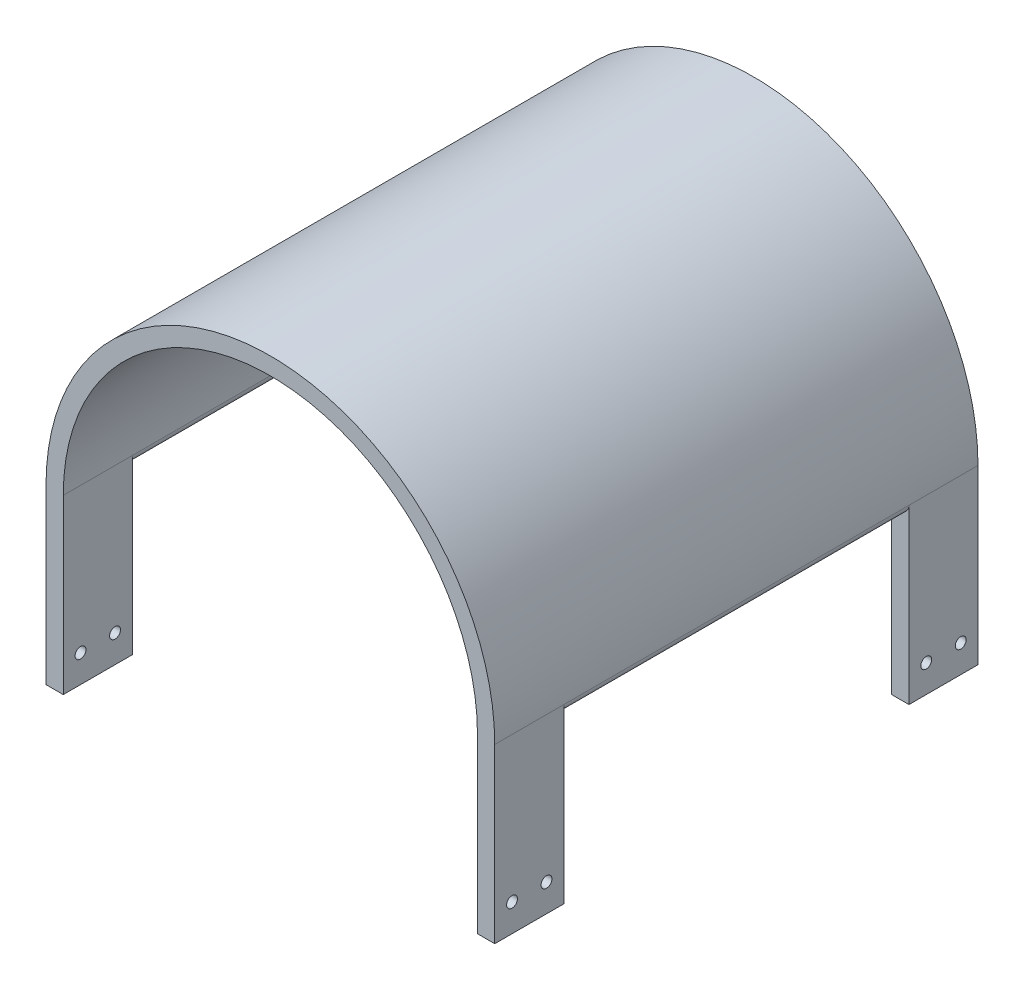
ISO-10303-21;
HEADER;
FILE_DESCRIPTION(('STEP AP214'),'2;1');
FILE_NAME('part.step','',(''),(''),'','','');
FILE_SCHEMA(('AUTOMOTIVE_DESIGN { 1 0 10303 214 1 1 1 1 }'));
ENDSEC;
DATA;
#1=APPLICATION_CONTEXT('core data for automotive mechanical design processes');
#2=APPLICATION_PROTOCOL_DEFINITION('international standard','automotive_design',2000,#1);
#3=PRODUCT_CONTEXT('',#1,'mechanical');
#4=PRODUCT('Part','Part','',(#3));
#5=PRODUCT_RELATED_PRODUCT_CATEGORY('part','',(#4));
#6=PRODUCT_DEFINITION_FORMATION('','',#4);
#7=PRODUCT_DEFINITION_CONTEXT('part definition',#1,'design');
#8=PRODUCT_DEFINITION('design','',#6,#7);
#9=PRODUCT_DEFINITION_SHAPE('','',#8);
#10=(LENGTH_UNIT() NAMED_UNIT(*) SI_UNIT(.MILLI.,.METRE.));
#11=(NAMED_UNIT(*) PLANE_ANGLE_UNIT() SI_UNIT($,.RADIAN.));
#12=(NAMED_UNIT(*) SI_UNIT($,.STERADIAN.) SOLID_ANGLE_UNIT());
#13=UNCERTAINTY_MEASURE_WITH_UNIT(LENGTH_MEASURE(1.E-05),#10,'distance_accuracy_value','');
#14=(GEOMETRIC_REPRESENTATION_CONTEXT(3) GLOBAL_UNCERTAINTY_ASSIGNED_CONTEXT((#13)) GLOBAL_UNIT_ASSIGNED_CONTEXT((#10,
#11,#12)) REPRESENTATION_CONTEXT('',''));
#15=CARTESIAN_POINT('',(0.,0.,0.));
#16=DIRECTION('',(0.,0.,1.));
#17=DIRECTION('',(1.,0.,0.));
#18=AXIS2_PLACEMENT_3D('',#15,#16,#17);
#19=CARTESIAN_POINT('',(0.,23.5227866990826,177.8));
#20=DIRECTION('',(0.,0.,-1.));
#21=DIRECTION('',(-1.,0.,0.));
#22=AXIS2_PLACEMENT_3D('',#19,#20,#21);
#23=CYLINDRICAL_SURFACE('',#22,82.55);
#24=CARTESIAN_POINT('',(0.,23.5227866990826,0.));
#25=DIRECTION('',(0.,0.,1.));
#26=DIRECTION('',(1.,0.,0.));
#27=AXIS2_PLACEMENT_3D('',#24,#25,#26);
#28=CIRCLE('',#27,82.55);
#29=CARTESIAN_POINT('',(82.55,23.5227866990823,0.));
#30=VERTEX_POINT('',#29);
#31=CARTESIAN_POINT('',(-82.55,23.5227866990824,0.));
#32=VERTEX_POINT('',#31);
#33=EDGE_CURVE('E310',#30,#32,#28,.T.);
#34=ORIENTED_EDGE('',*,*,#33,.T.);
#35=DIRECTION('',(0.,0.,1.));
#36=VECTOR('',#35,1.);
#37=CARTESIAN_POINT('',(-82.55,23.5227866990823,0.));
#38=LINE('',#37,#36);
#39=CARTESIAN_POINT('',(-82.55,23.5227866990823,25.4));
#40=VERTEX_POINT('',#39);
#41=EDGE_CURVE('E189',#32,#40,#38,.T.);
#42=ORIENTED_EDGE('',*,*,#41,.T.);
#43=DIRECTION('',(0.,0.,-1.));
#44=VECTOR('',#43,1.);
#45=CARTESIAN_POINT('',(-82.55,23.5227866990824,177.8));
#46=LINE('',#45,#44);
#47=CARTESIAN_POINT('',(-82.55,23.5227866990823,152.4));
#48=VERTEX_POINT('',#47);
#49=EDGE_CURVE('E49',#48,#40,#46,.T.);
#50=ORIENTED_EDGE('',*,*,#49,.F.);
#51=CARTESIAN_POINT('',(-82.55,23.5227866990823,177.8));
#52=VERTEX_POINT('',#51);
#53=EDGE_CURVE('E11',#52,#48,#46,.T.);
#54=ORIENTED_EDGE('',*,*,#53,.F.);
#55=CARTESIAN_POINT('',(0.,23.5227866990826,177.8));
#56=DIRECTION('',(0.,0.,1.));
#57=DIRECTION('',(1.,0.,0.));
#58=AXIS2_PLACEMENT_3D('',#55,#56,#57);
#59=CIRCLE('',#58,82.55);
#60=CARTESIAN_POINT('',(82.55,23.5227866990824,177.8));
#61=VERTEX_POINT('',#60);
#62=EDGE_CURVE('E311',#61,#52,#59,.T.);
#63=ORIENTED_EDGE('',*,*,#62,.F.);
#64=DIRECTION('',(0.,0.,-1.));
#65=VECTOR('',#64,1.);
#66=CARTESIAN_POINT('',(82.55,23.5227866990824,177.8));
#67=LINE('',#66,#65);
#68=CARTESIAN_POINT('',(82.55,23.5227866990824,152.4));
#69=VERTEX_POINT('',#68);
#70=EDGE_CURVE('E324',#61,#69,#67,.T.);
#71=ORIENTED_EDGE('',*,*,#70,.T.);
#72=CARTESIAN_POINT('',(82.55,23.5227866990823,25.4));
#73=VERTEX_POINT('',#72);
#74=EDGE_CURVE('E64',#69,#73,#67,.T.);
#75=ORIENTED_EDGE('',*,*,#74,.T.);
#76=DIRECTION('',(0.,0.,1.));
#77=VECTOR('',#76,1.);
#78=CARTESIAN_POINT('',(82.55,23.5227866990823,0.));
#79=LINE('',#78,#77);
#80=EDGE_CURVE('E281',#30,#73,#79,.T.);
#81=ORIENTED_EDGE('',*,*,#80,.F.);
#82=EDGE_LOOP('',(#34,#42,#50,#54,#63,#71,#75,#81));
#83=FACE_BOUND('',#82,.T.);
#84=ADVANCED_FACE('F41',(#83),#23,.T.);
#85=CARTESIAN_POINT('',(0.,23.5227866990826,177.8));
#86=DIRECTION('',(0.,0.,-1.));
#87=DIRECTION('',(-1.,0.,0.));
#88=AXIS2_PLACEMENT_3D('',#85,#86,#87);
#89=CYLINDRICAL_SURFACE('',#88,76.2);
#90=CARTESIAN_POINT('',(0.,23.5227866990826,0.));
#91=DIRECTION('',(0.,0.,1.));
#92=DIRECTION('',(1.,0.,0.));
#93=AXIS2_PLACEMENT_3D('',#90,#91,#92);
#94=CIRCLE('',#93,76.2);
#95=CARTESIAN_POINT('',(76.2,23.5227866990824,0.));
#96=VERTEX_POINT('',#95);
#97=CARTESIAN_POINT('',(-76.2,23.5227866990824,0.));
#98=VERTEX_POINT('',#97);
#99=EDGE_CURVE('E316',#96,#98,#94,.T.);
#100=ORIENTED_EDGE('',*,*,#99,.F.);
#101=DIRECTION('',(0.,0.,-1.));
#102=VECTOR('',#101,1.);
#103=CARTESIAN_POINT('',(76.2,23.5227866990824,0.));
#104=LINE('',#103,#102);
#105=CARTESIAN_POINT('',(76.2,23.5227866990823,25.4));
#106=VERTEX_POINT('',#105);
#107=EDGE_CURVE('E269',#106,#96,#104,.T.);
#108=ORIENTED_EDGE('',*,*,#107,.F.);
#109=DIRECTION('',(0.,0.,-1.));
#110=VECTOR('',#109,1.);
#111=CARTESIAN_POINT('',(76.2,23.5227866990824,177.8));
#112=LINE('',#111,#110);
#113=CARTESIAN_POINT('',(76.2,23.5227866990823,152.4));
#114=VERTEX_POINT('',#113);
#115=EDGE_CURVE('E328',#114,#106,#112,.T.);
#116=ORIENTED_EDGE('',*,*,#115,.F.);
#117=CARTESIAN_POINT('',(76.2,23.5227866990824,177.8));
#118=VERTEX_POINT('',#117);
#119=EDGE_CURVE('E173',#118,#114,#112,.T.);
#120=ORIENTED_EDGE('',*,*,#119,.F.);
#121=CARTESIAN_POINT('',(0.,23.5227866990826,177.8));
#122=DIRECTION('',(0.,0.,1.));
#123=DIRECTION('',(1.,0.,0.));
#124=AXIS2_PLACEMENT_3D('',#121,#122,#123);
#125=CIRCLE('',#124,76.2);
#126=CARTESIAN_POINT('',(-76.2,23.5227866990824,177.8));
#127=VERTEX_POINT('',#126);
#128=EDGE_CURVE('E315',#118,#127,#125,.T.);
#129=ORIENTED_EDGE('',*,*,#128,.T.);
#130=DIRECTION('',(0.,0.,-1.));
#131=VECTOR('',#130,1.);
#132=CARTESIAN_POINT('',(-76.2,23.5227866990824,177.8));
#133=LINE('',#132,#131);
#134=CARTESIAN_POINT('',(-76.2,23.5227866990824,152.4));
#135=VERTEX_POINT('',#134);
#136=EDGE_CURVE('E170',#127,#135,#133,.T.);
#137=ORIENTED_EDGE('',*,*,#136,.T.);
#138=CARTESIAN_POINT('',(-76.2,23.5227866990823,25.4));
#139=VERTEX_POINT('',#138);
#140=EDGE_CURVE('E56',#135,#139,#133,.T.);
#141=ORIENTED_EDGE('',*,*,#140,.T.);
#142=DIRECTION('',(0.,0.,-1.));
#143=VECTOR('',#142,1.);
#144=CARTESIAN_POINT('',(-76.2,23.5227866990824,0.));
#145=LINE('',#144,#143);
#146=EDGE_CURVE('E167',#139,#98,#145,.T.);
#147=ORIENTED_EDGE('',*,*,#146,.T.);
#148=EDGE_LOOP('',(#100,#108,#116,#120,#129,#137,#141,#147));
#149=FACE_BOUND('',#148,.T.);
#150=ADVANCED_FACE('F165',(#149),#89,.F.);
#151=CARTESIAN_POINT('',(0.,23.5227866990826,177.8));
#152=DIRECTION('',(0.,0.,1.));
#153=DIRECTION('',(1.,0.,0.));
#154=AXIS2_PLACEMENT_3D('',#151,#152,#153);
#155=PLANE('',#154);
#156=ORIENTED_EDGE('',*,*,#62,.T.);
#157=DIRECTION('',(0.,1.,0.));
#158=VECTOR('',#157,1.);
#159=CARTESIAN_POINT('',(-82.5499999999996,-39.9772133009177,177.8));
#160=LINE('',#159,#158);
#161=CARTESIAN_POINT('',(-82.5499999999996,-39.9772133009177,177.8));
#162=VERTEX_POINT('',#161);
#163=EDGE_CURVE('E198',#162,#52,#160,.T.);
#164=ORIENTED_EDGE('',*,*,#163,.F.);
#165=DIRECTION('',(-1.,0.,0.));
#166=VECTOR('',#165,1.);
#167=CARTESIAN_POINT('',(-76.1999999999996,-39.9772133009176,177.8));
#168=LINE('',#167,#166);
#169=CARTESIAN_POINT('',(-76.1999999999996,-39.9772133009176,177.8));
#170=VERTEX_POINT('',#169);
#171=EDGE_CURVE('E362',#170,#162,#168,.T.);
#172=ORIENTED_EDGE('',*,*,#171,.F.);
#173=DIRECTION('',(0.,1.,0.));
#174=VECTOR('',#173,1.);
#175=CARTESIAN_POINT('',(-76.1999999999996,-39.9772133009176,177.8));
#176=LINE('',#175,#174);
#177=EDGE_CURVE('E190',#170,#127,#176,.T.);
#178=ORIENTED_EDGE('',*,*,#177,.T.);
#179=ORIENTED_EDGE('',*,*,#128,.F.);
#180=DIRECTION('',(0.,1.,0.));
#181=VECTOR('',#180,1.);
#182=CARTESIAN_POINT('',(76.1999999999996,-39.9772133009176,177.8));
#183=LINE('',#182,#181);
#184=CARTESIAN_POINT('',(76.1999999999996,-39.9772133009176,177.8));
#185=VERTEX_POINT('',#184);
#186=EDGE_CURVE('E243',#185,#118,#183,.T.);
#187=ORIENTED_EDGE('',*,*,#186,.F.);
#188=DIRECTION('',(1.,0.,0.));
#189=VECTOR('',#188,1.);
#190=CARTESIAN_POINT('',(76.1999999999996,-39.9772133009176,177.8));
#191=LINE('',#190,#189);
#192=CARTESIAN_POINT('',(82.5499999999996,-39.9772133009177,177.8));
#193=VERTEX_POINT('',#192);
#194=EDGE_CURVE('E239',#185,#193,#191,.T.);
#195=ORIENTED_EDGE('',*,*,#194,.T.);
#196=DIRECTION('',(0.,1.,0.));
#197=VECTOR('',#196,1.);
#198=CARTESIAN_POINT('',(82.5499999999996,-39.9772133009177,177.8));
#199=LINE('',#198,#197);
#200=EDGE_CURVE('E247',#193,#61,#199,.T.);
#201=ORIENTED_EDGE('',*,*,#200,.T.);
#202=EDGE_LOOP('',(#156,#164,#172,#178,#179,#187,#195,#201));
#203=FACE_BOUND('',#202,.T.);
#204=ADVANCED_FACE('F423',(#203),#155,.T.);
#205=CARTESIAN_POINT('',(0.,23.5227866990826,0.));
#206=DIRECTION('',(0.,0.,1.));
#207=DIRECTION('',(1.,0.,0.));
#208=AXIS2_PLACEMENT_3D('',#205,#206,#207);
#209=PLANE('',#208);
#210=ORIENTED_EDGE('',*,*,#33,.F.);
#211=DIRECTION('',(0.,1.,0.));
#212=VECTOR('',#211,1.);
#213=CARTESIAN_POINT('',(82.5499999999996,-39.9772133009177,0.));
#214=LINE('',#213,#212);
#215=CARTESIAN_POINT('',(82.5499999999996,-39.9772133009177,0.));
#216=VERTEX_POINT('',#215);
#217=EDGE_CURVE('E303',#216,#30,#214,.T.);
#218=ORIENTED_EDGE('',*,*,#217,.F.);
#219=DIRECTION('',(1.,0.,0.));
#220=VECTOR('',#219,1.);
#221=CARTESIAN_POINT('',(76.1999999999996,-39.9772133009176,0.));
#222=LINE('',#221,#220);
#223=CARTESIAN_POINT('',(76.1999999999996,-39.9772133009176,0.));
#224=VERTEX_POINT('',#223);
#225=EDGE_CURVE('E280',#224,#216,#222,.T.);
#226=ORIENTED_EDGE('',*,*,#225,.F.);
#227=DIRECTION('',(0.,1.,0.));
#228=VECTOR('',#227,1.);
#229=CARTESIAN_POINT('',(76.1999999999996,-39.9772133009176,0.));
#230=LINE('',#229,#228);
#231=EDGE_CURVE('E306',#224,#96,#230,.T.);
#232=ORIENTED_EDGE('',*,*,#231,.T.);
#233=ORIENTED_EDGE('',*,*,#99,.T.);
#234=DIRECTION('',(0.,1.,0.));
#235=VECTOR('',#234,1.);
#236=CARTESIAN_POINT('',(-76.1999999999996,-39.9772133009176,0.));
#237=LINE('',#236,#235);
#238=CARTESIAN_POINT('',(-76.1999999999996,-39.9772133009176,0.));
#239=VERTEX_POINT('',#238);
#240=EDGE_CURVE('E187',#239,#98,#237,.T.);
#241=ORIENTED_EDGE('',*,*,#240,.F.);
#242=DIRECTION('',(-1.,0.,0.));
#243=VECTOR('',#242,1.);
#244=CARTESIAN_POINT('',(-76.1999999999996,-39.9772133009176,0.));
#245=LINE('',#244,#243);
#246=CARTESIAN_POINT('',(-82.5499999999996,-39.9772133009177,0.));
#247=VERTEX_POINT('',#246);
#248=EDGE_CURVE('E201',#239,#247,#245,.T.);
#249=ORIENTED_EDGE('',*,*,#248,.T.);
#250=DIRECTION('',(0.,1.,0.));
#251=VECTOR('',#250,1.);
#252=CARTESIAN_POINT('',(-82.5499999999996,-39.9772133009177,0.));
#253=LINE('',#252,#251);
#254=EDGE_CURVE('E206',#247,#32,#253,.T.);
#255=ORIENTED_EDGE('',*,*,#254,.T.);
#256=EDGE_LOOP('',(#210,#218,#226,#232,#233,#241,#249,#255));
#257=FACE_BOUND('',#256,.T.);
#258=ADVANCED_FACE('F460',(#257),#209,.F.);
#259=CARTESIAN_POINT('',(76.1999999999996,-39.9772133009176,0.));
#260=DIRECTION('',(1.,0.,0.));
#261=DIRECTION('',(0.,1.,0.));
#262=AXIS2_PLACEMENT_3D('',#259,#260,#261);
#263=PLANE('',#262);
#264=CARTESIAN_POINT('',(76.1999999999997,-29.8172133009176,6.35));
#265=DIRECTION('',(-1.,0.,0.));
#266=DIRECTION('',(0.,-1.,0.));
#267=AXIS2_PLACEMENT_3D('',#264,#265,#266);
#268=CIRCLE('',#267,2.);
#269=CARTESIAN_POINT('',(76.1999999999997,-31.8172133009176,6.35));
#270=VERTEX_POINT('',#269);
#271=EDGE_CURVE('E260',#270,#270,#268,.T.);
#272=ORIENTED_EDGE('',*,*,#271,.F.);
#273=EDGE_LOOP('',(#272));
#274=FACE_BOUND('',#273,.T.);
#275=CARTESIAN_POINT('',(76.1999999999997,-29.8172133009176,19.05));
#276=DIRECTION('',(-1.,0.,0.));
#277=DIRECTION('',(0.,1.,0.));
#278=AXIS2_PLACEMENT_3D('',#275,#276,#277);
#279=CIRCLE('',#278,2.00000000000001);
#280=CARTESIAN_POINT('',(76.1999999999997,-27.8172133009176,19.05));
#281=VERTEX_POINT('',#280);
#282=EDGE_CURVE('E259',#281,#281,#279,.T.);
#283=ORIENTED_EDGE('',*,*,#282,.F.);
#284=EDGE_LOOP('',(#283));
#285=FACE_BOUND('',#284,.T.);
#286=ORIENTED_EDGE('',*,*,#107,.T.);
#287=ORIENTED_EDGE('',*,*,#231,.F.);
#288=DIRECTION('',(0.,0.,-1.));
#289=VECTOR('',#288,1.);
#290=CARTESIAN_POINT('',(76.1999999999996,-39.9772133009176,0.));
#291=LINE('',#290,#289);
#292=CARTESIAN_POINT('',(76.1999999999996,-39.9772133009176,25.4));
#293=VERTEX_POINT('',#292);
#294=EDGE_CURVE('E276',#293,#224,#291,.T.);
#295=ORIENTED_EDGE('',*,*,#294,.F.);
#296=DIRECTION('',(0.,1.,0.));
#297=VECTOR('',#296,1.);
#298=CARTESIAN_POINT('',(76.1999999999996,-39.9772133009176,25.4));
#299=LINE('',#298,#297);
#300=EDGE_CURVE('E290',#293,#106,#299,.T.);
#301=ORIENTED_EDGE('',*,*,#300,.T.);
#302=EDGE_LOOP('',(#286,#287,#295,#301));
#303=FACE_BOUND('',#302,.T.);
#304=ADVANCED_FACE('F450',(#274,#285,#303),#263,.F.);
#305=CARTESIAN_POINT('',(82.5499999999996,-39.9772133009177,0.));
#306=DIRECTION('',(-1.,0.,0.));
#307=DIRECTION('',(0.,-1.,0.));
#308=AXIS2_PLACEMENT_3D('',#305,#306,#307);
#309=PLANE('',#308);
#310=CARTESIAN_POINT('',(82.5499999999997,-29.8172133009177,6.35));
#311=DIRECTION('',(-1.,0.,0.));
#312=DIRECTION('',(0.,-1.,0.));
#313=AXIS2_PLACEMENT_3D('',#310,#311,#312);
#314=CIRCLE('',#313,2.);
#315=CARTESIAN_POINT('',(82.5499999999997,-31.8172133009177,6.35));
#316=VERTEX_POINT('',#315);
#317=EDGE_CURVE('E264',#316,#316,#314,.F.);
#318=ORIENTED_EDGE('',*,*,#317,.F.);
#319=EDGE_LOOP('',(#318));
#320=FACE_BOUND('',#319,.T.);
#321=CARTESIAN_POINT('',(82.5499999999997,-29.8172133009177,19.05));
#322=DIRECTION('',(-1.,0.,0.));
#323=DIRECTION('',(0.,-1.,0.));
#324=AXIS2_PLACEMENT_3D('',#321,#322,#323);
#325=CIRCLE('',#324,2.00000000000001);
#326=CARTESIAN_POINT('',(82.5499999999997,-31.8172133009177,19.05));
#327=VERTEX_POINT('',#326);
#328=EDGE_CURVE('E265',#327,#327,#325,.F.);
#329=ORIENTED_EDGE('',*,*,#328,.F.);
#330=EDGE_LOOP('',(#329));
#331=FACE_BOUND('',#330,.T.);
#332=ORIENTED_EDGE('',*,*,#80,.T.);
#333=DIRECTION('',(0.,1.,0.));
#334=VECTOR('',#333,1.);
#335=CARTESIAN_POINT('',(82.5499999999996,-39.9772133009177,25.4));
#336=LINE('',#335,#334);
#337=CARTESIAN_POINT('',(82.5499999999996,-39.9772133009177,25.4));
#338=VERTEX_POINT('',#337);
#339=EDGE_CURVE('E299',#338,#73,#336,.T.);
#340=ORIENTED_EDGE('',*,*,#339,.F.);
#341=DIRECTION('',(0.,0.,1.));
#342=VECTOR('',#341,1.);
#343=CARTESIAN_POINT('',(82.5499999999996,-39.9772133009177,0.));
#344=LINE('',#343,#342);
#345=EDGE_CURVE('E284',#216,#338,#344,.T.);
#346=ORIENTED_EDGE('',*,*,#345,.F.);
#347=ORIENTED_EDGE('',*,*,#217,.T.);
#348=EDGE_LOOP('',(#332,#340,#346,#347));
#349=FACE_BOUND('',#348,.T.);
#350=ADVANCED_FACE('F457',(#320,#331,#349),#309,.F.);
#351=CARTESIAN_POINT('',(76.1999999999996,-39.9772133009176,25.4));
#352=DIRECTION('',(0.,0.,-1.));
#353=DIRECTION('',(-1.,0.,0.));
#354=AXIS2_PLACEMENT_3D('',#351,#352,#353);
#355=PLANE('',#354);
#356=CARTESIAN_POINT('',(79.375,23.5227866990823,25.4));
#357=DIRECTION('',(0.,0.,1.));
#358=DIRECTION('',(1.,0.,0.));
#359=AXIS2_PLACEMENT_3D('',#356,#357,#358);
#360=CIRCLE('',#359,3.175);
#361=EDGE_CURVE('E404',#106,#73,#360,.T.);
#362=ORIENTED_EDGE('',*,*,#361,.F.);
#363=ORIENTED_EDGE('',*,*,#300,.F.);
#364=DIRECTION('',(-1.,0.,0.));
#365=VECTOR('',#364,1.);
#366=CARTESIAN_POINT('',(76.1999999999996,-39.9772133009176,25.4));
#367=LINE('',#366,#365);
#368=EDGE_CURVE('E287',#338,#293,#367,.T.);
#369=ORIENTED_EDGE('',*,*,#368,.F.);
#370=ORIENTED_EDGE('',*,*,#339,.T.);
#371=EDGE_LOOP('',(#362,#363,#369,#370));
#372=FACE_BOUND('',#371,.T.);
#373=ADVANCED_FACE('F445',(#372),#355,.F.);
#374=CARTESIAN_POINT('',(-2.41084463367138E-13,-39.9772133009172,0.));
#375=DIRECTION('',(0.,1.,0.));
#376=DIRECTION('',(-1.,0.,0.));
#377=AXIS2_PLACEMENT_3D('',#374,#375,#376);
#378=PLANE('',#377);
#379=ORIENTED_EDGE('',*,*,#294,.T.);
#380=ORIENTED_EDGE('',*,*,#225,.T.);
#381=ORIENTED_EDGE('',*,*,#345,.T.);
#382=ORIENTED_EDGE('',*,*,#368,.T.);
#383=EDGE_LOOP('',(#379,#380,#381,#382));
#384=FACE_BOUND('',#383,.T.);
#385=ADVANCED_FACE('F453',(#384),#378,.F.);
#386=CARTESIAN_POINT('',(82.5510000000001,-29.8172133009177,19.05));
#387=DIRECTION('',(-1.,0.,0.));
#388=DIRECTION('',(0.,-1.,0.));
#389=AXIS2_PLACEMENT_3D('',#386,#387,#388);
#390=CYLINDRICAL_SURFACE('',#389,2.00000000000001);
#391=ORIENTED_EDGE('',*,*,#282,.T.);
#392=EDGE_LOOP('',(#391));
#393=FACE_BOUND('',#392,.T.);
#394=ORIENTED_EDGE('',*,*,#328,.T.);
#395=EDGE_LOOP('',(#394));
#396=FACE_BOUND('',#395,.T.);
#397=ADVANCED_FACE('F498',(#393,#396),#390,.F.);
#398=CARTESIAN_POINT('',(82.5510000000001,-29.8172133009177,6.35));
#399=DIRECTION('',(-1.,0.,0.));
#400=DIRECTION('',(0.,-1.,0.));
#401=AXIS2_PLACEMENT_3D('',#398,#399,#400);
#402=CYLINDRICAL_SURFACE('',#401,2.);
#403=ORIENTED_EDGE('',*,*,#271,.T.);
#404=EDGE_LOOP('',(#403));
#405=FACE_BOUND('',#404,.T.);
#406=ORIENTED_EDGE('',*,*,#317,.T.);
#407=EDGE_LOOP('',(#406));
#408=FACE_BOUND('',#407,.T.);
#409=ADVANCED_FACE('F501',(#405,#408),#402,.F.);
#410=CARTESIAN_POINT('',(76.1999999999996,-39.9772133009176,177.8));
#411=DIRECTION('',(-1.,0.,0.));
#412=DIRECTION('',(0.,-1.,0.));
#413=AXIS2_PLACEMENT_3D('',#410,#411,#412);
#414=PLANE('',#413);
#415=CARTESIAN_POINT('',(76.1999999999997,-29.8172133009176,171.45));
#416=DIRECTION('',(1.,0.,0.));
#417=DIRECTION('',(0.,-1.,0.));
#418=AXIS2_PLACEMENT_3D('',#415,#416,#417);
#419=CIRCLE('',#418,2.);
#420=CARTESIAN_POINT('',(76.1999999999997,-31.8172133009176,171.45));
#421=VERTEX_POINT('',#420);
#422=EDGE_CURVE('E212',#421,#421,#419,.T.);
#423=ORIENTED_EDGE('',*,*,#422,.T.);
#424=EDGE_LOOP('',(#423));
#425=FACE_BOUND('',#424,.T.);
#426=CARTESIAN_POINT('',(76.1999999999997,-29.8172133009176,158.75));
#427=DIRECTION('',(1.,0.,0.));
#428=DIRECTION('',(0.,1.,0.));
#429=AXIS2_PLACEMENT_3D('',#426,#427,#428);
#430=CIRCLE('',#429,2.00000000000001);
#431=CARTESIAN_POINT('',(76.1999999999997,-27.8172133009176,158.75));
#432=VERTEX_POINT('',#431);
#433=EDGE_CURVE('E183',#432,#432,#430,.T.);
#434=ORIENTED_EDGE('',*,*,#433,.T.);
#435=EDGE_LOOP('',(#434));
#436=FACE_BOUND('',#435,.T.);
#437=ORIENTED_EDGE('',*,*,#119,.T.);
#438=DIRECTION('',(0.,1.,0.));
#439=VECTOR('',#438,1.);
#440=CARTESIAN_POINT('',(76.1999999999996,-39.9772133009176,152.4));
#441=LINE('',#440,#439);
#442=CARTESIAN_POINT('',(76.1999999999996,-39.9772133009176,152.4));
#443=VERTEX_POINT('',#442);
#444=EDGE_CURVE('E255',#443,#114,#441,.T.);
#445=ORIENTED_EDGE('',*,*,#444,.F.);
#446=DIRECTION('',(0.,0.,1.));
#447=VECTOR('',#446,1.);
#448=CARTESIAN_POINT('',(76.1999999999996,-39.9772133009176,177.8));
#449=LINE('',#448,#447);
#450=EDGE_CURVE('E221',#443,#185,#449,.T.);
#451=ORIENTED_EDGE('',*,*,#450,.T.);
#452=ORIENTED_EDGE('',*,*,#186,.T.);
#453=EDGE_LOOP('',(#437,#445,#451,#452));
#454=FACE_BOUND('',#453,.T.);
#455=ADVANCED_FACE('F437',(#425,#436,#454),#414,.T.);
#456=CARTESIAN_POINT('',(76.1999999999996,-39.9772133009176,152.4));
#457=DIRECTION('',(0.,0.,-1.));
#458=DIRECTION('',(-1.,0.,0.));
#459=AXIS2_PLACEMENT_3D('',#456,#457,#458);
#460=PLANE('',#459);
#461=ORIENTED_EDGE('',*,*,#444,.T.);
#462=CARTESIAN_POINT('',(79.375,23.5227866990823,152.4));
#463=DIRECTION('',(0.,0.,-1.));
#464=DIRECTION('',(-1.,0.,0.));
#465=AXIS2_PLACEMENT_3D('',#462,#463,#464);
#466=CIRCLE('',#465,3.175);
#467=EDGE_CURVE('E395',#69,#114,#466,.T.);
#468=ORIENTED_EDGE('',*,*,#467,.F.);
#469=DIRECTION('',(0.,1.,0.));
#470=VECTOR('',#469,1.);
#471=CARTESIAN_POINT('',(82.5499999999996,-39.9772133009177,152.4));
#472=LINE('',#471,#470);
#473=CARTESIAN_POINT('',(82.5499999999996,-39.9772133009177,152.4));
#474=VERTEX_POINT('',#473);
#475=EDGE_CURVE('E251',#474,#69,#472,.T.);
#476=ORIENTED_EDGE('',*,*,#475,.F.);
#477=DIRECTION('',(-1.,0.,0.));
#478=VECTOR('',#477,1.);
#479=CARTESIAN_POINT('',(76.1999999999996,-39.9772133009176,152.4));
#480=LINE('',#479,#478);
#481=EDGE_CURVE('E231',#474,#443,#480,.T.);
#482=ORIENTED_EDGE('',*,*,#481,.T.);
#483=EDGE_LOOP('',(#461,#468,#476,#482));
#484=FACE_BOUND('',#483,.T.);
#485=ADVANCED_FACE('F431',(#484),#460,.T.);
#486=CARTESIAN_POINT('',(82.5499999999996,-39.9772133009177,177.8));
#487=DIRECTION('',(1.,0.,0.));
#488=DIRECTION('',(0.,1.,0.));
#489=AXIS2_PLACEMENT_3D('',#486,#487,#488);
#490=PLANE('',#489);
#491=CARTESIAN_POINT('',(82.5499999999997,-29.8172133009177,171.45));
#492=DIRECTION('',(1.,0.,0.));
#493=DIRECTION('',(0.,1.,0.));
#494=AXIS2_PLACEMENT_3D('',#491,#492,#493);
#495=CIRCLE('',#494,2.);
#496=CARTESIAN_POINT('',(82.5499999999997,-27.8172133009177,171.45));
#497=VERTEX_POINT('',#496);
#498=EDGE_CURVE('E216',#497,#497,#495,.T.);
#499=ORIENTED_EDGE('',*,*,#498,.F.);
#500=EDGE_LOOP('',(#499));
#501=FACE_BOUND('',#500,.T.);
#502=CARTESIAN_POINT('',(82.5499999999997,-29.8172133009177,158.75));
#503=DIRECTION('',(1.,0.,0.));
#504=DIRECTION('',(0.,1.,0.));
#505=AXIS2_PLACEMENT_3D('',#502,#503,#504);
#506=CIRCLE('',#505,2.00000000000001);
#507=CARTESIAN_POINT('',(82.5499999999997,-27.8172133009177,158.75));
#508=VERTEX_POINT('',#507);
#509=EDGE_CURVE('E217',#508,#508,#506,.T.);
#510=ORIENTED_EDGE('',*,*,#509,.F.);
#511=EDGE_LOOP('',(#510));
#512=FACE_BOUND('',#511,.T.);
#513=ORIENTED_EDGE('',*,*,#70,.F.);
#514=ORIENTED_EDGE('',*,*,#200,.F.);
#515=DIRECTION('',(0.,0.,-1.));
#516=VECTOR('',#515,1.);
#517=CARTESIAN_POINT('',(82.5499999999996,-39.9772133009177,177.8));
#518=LINE('',#517,#516);
#519=EDGE_CURVE('E235',#193,#474,#518,.T.);
#520=ORIENTED_EDGE('',*,*,#519,.T.);
#521=ORIENTED_EDGE('',*,*,#475,.T.);
#522=EDGE_LOOP('',(#513,#514,#520,#521));
#523=FACE_BOUND('',#522,.T.);
#524=ADVANCED_FACE('F427',(#501,#512,#523),#490,.T.);
#525=CARTESIAN_POINT('',(-2.41084463367138E-13,-39.9772133009172,177.8));
#526=DIRECTION('',(0.,1.,0.));
#527=DIRECTION('',(-1.,0.,0.));
#528=AXIS2_PLACEMENT_3D('',#525,#526,#527);
#529=PLANE('',#528);
#530=ORIENTED_EDGE('',*,*,#450,.F.);
#531=ORIENTED_EDGE('',*,*,#481,.F.);
#532=ORIENTED_EDGE('',*,*,#519,.F.);
#533=ORIENTED_EDGE('',*,*,#194,.F.);
#534=EDGE_LOOP('',(#530,#531,#532,#533));
#535=FACE_BOUND('',#534,.T.);
#536=ADVANCED_FACE('F434',(#535),#529,.F.);
#537=CARTESIAN_POINT('',(82.5510000000001,-29.8172133009177,158.75));
#538=DIRECTION('',(-1.,0.,0.));
#539=DIRECTION('',(0.,-1.,0.));
#540=AXIS2_PLACEMENT_3D('',#537,#538,#539);
#541=CYLINDRICAL_SURFACE('',#540,2.00000000000001);
#542=ORIENTED_EDGE('',*,*,#509,.T.);
#543=EDGE_LOOP('',(#542));
#544=FACE_BOUND('',#543,.T.);
#545=ORIENTED_EDGE('',*,*,#433,.F.);
#546=EDGE_LOOP('',(#545));
#547=FACE_BOUND('',#546,.T.);
#548=ADVANCED_FACE('F516',(#544,#547),#541,.F.);
#549=CARTESIAN_POINT('',(82.5510000000001,-29.8172133009177,171.45));
#550=DIRECTION('',(-1.,0.,0.));
#551=DIRECTION('',(0.,-1.,0.));
#552=AXIS2_PLACEMENT_3D('',#549,#550,#551);
#553=CYLINDRICAL_SURFACE('',#552,2.);
#554=ORIENTED_EDGE('',*,*,#498,.T.);
#555=EDGE_LOOP('',(#554));
#556=FACE_BOUND('',#555,.T.);
#557=ORIENTED_EDGE('',*,*,#422,.F.);
#558=EDGE_LOOP('',(#557));
#559=FACE_BOUND('',#558,.T.);
#560=ADVANCED_FACE('F519',(#556,#559),#553,.F.);
#561=CARTESIAN_POINT('',(-76.1999999999996,-39.9772133009176,0.));
#562=DIRECTION('',(1.,0.,0.));
#563=DIRECTION('',(0.,1.,0.));
#564=AXIS2_PLACEMENT_3D('',#561,#562,#563);
#565=PLANE('',#564);
#566=CARTESIAN_POINT('',(-76.1999999999997,-29.8172133009176,6.35));
#567=DIRECTION('',(-1.,0.,0.));
#568=DIRECTION('',(0.,-1.,0.));
#569=AXIS2_PLACEMENT_3D('',#566,#567,#568);
#570=CIRCLE('',#569,2.);
#571=CARTESIAN_POINT('',(-76.1999999999997,-31.8172133009176,6.35));
#572=VERTEX_POINT('',#571);
#573=EDGE_CURVE('E390',#572,#572,#570,.T.);
#574=ORIENTED_EDGE('',*,*,#573,.T.);
#575=EDGE_LOOP('',(#574));
#576=FACE_BOUND('',#575,.T.);
#577=CARTESIAN_POINT('',(-76.1999999999997,-29.8172133009176,19.05));
#578=DIRECTION('',(-1.,0.,0.));
#579=DIRECTION('',(0.,1.,0.));
#580=AXIS2_PLACEMENT_3D('',#577,#578,#579);
#581=CIRCLE('',#580,2.00000000000001);
#582=CARTESIAN_POINT('',(-76.1999999999997,-27.8172133009176,19.05));
#583=VERTEX_POINT('',#582);
#584=EDGE_CURVE('E391',#583,#583,#581,.T.);
#585=ORIENTED_EDGE('',*,*,#584,.T.);
#586=EDGE_LOOP('',(#585));
#587=FACE_BOUND('',#586,.T.);
#588=ORIENTED_EDGE('',*,*,#146,.F.);
#589=DIRECTION('',(0.,1.,0.));
#590=VECTOR('',#589,1.);
#591=CARTESIAN_POINT('',(-76.1999999999996,-39.9772133009176,25.4));
#592=LINE('',#591,#590);
#593=CARTESIAN_POINT('',(-76.1999999999996,-39.9772133009176,25.4));
#594=VERTEX_POINT('',#593);
#595=EDGE_CURVE('E175',#594,#139,#592,.T.);
#596=ORIENTED_EDGE('',*,*,#595,.F.);
#597=DIRECTION('',(0.,0.,-1.));
#598=VECTOR('',#597,1.);
#599=CARTESIAN_POINT('',(-76.1999999999996,-39.9772133009176,0.));
#600=LINE('',#599,#598);
#601=EDGE_CURVE('E195',#594,#239,#600,.T.);
#602=ORIENTED_EDGE('',*,*,#601,.T.);
#603=ORIENTED_EDGE('',*,*,#240,.T.);
#604=EDGE_LOOP('',(#588,#596,#602,#603));
#605=FACE_BOUND('',#604,.T.);
#606=ADVANCED_FACE('F186',(#576,#587,#605),#565,.T.);
#607=CARTESIAN_POINT('',(-76.1999999999996,-39.9772133009176,25.4));
#608=DIRECTION('',(0.,0.,1.));
#609=DIRECTION('',(1.,0.,0.));
#610=AXIS2_PLACEMENT_3D('',#607,#608,#609);
#611=PLANE('',#610);
#612=CARTESIAN_POINT('',(-79.375,23.5227866990823,25.4));
#613=DIRECTION('',(0.,0.,-1.));
#614=DIRECTION('',(-1.,0.,0.));
#615=AXIS2_PLACEMENT_3D('',#612,#613,#614);
#616=CIRCLE('',#615,3.175);
#617=EDGE_CURVE('E152',#139,#40,#616,.T.);
#618=ORIENTED_EDGE('',*,*,#617,.T.);
#619=DIRECTION('',(0.,1.,0.));
#620=VECTOR('',#619,1.);
#621=CARTESIAN_POINT('',(-82.5499999999996,-39.9772133009177,25.4));
#622=LINE('',#621,#620);
#623=CARTESIAN_POINT('',(-82.5499999999996,-39.9772133009177,25.4));
#624=VERTEX_POINT('',#623);
#625=EDGE_CURVE('E184',#624,#40,#622,.T.);
#626=ORIENTED_EDGE('',*,*,#625,.F.);
#627=DIRECTION('',(1.,0.,0.));
#628=VECTOR('',#627,1.);
#629=CARTESIAN_POINT('',(-76.1999999999996,-39.9772133009176,25.4));
#630=LINE('',#629,#628);
#631=EDGE_CURVE('E178',#624,#594,#630,.T.);
#632=ORIENTED_EDGE('',*,*,#631,.T.);
#633=ORIENTED_EDGE('',*,*,#595,.T.);
#634=EDGE_LOOP('',(#618,#626,#632,#633));
#635=FACE_BOUND('',#634,.T.);
#636=ADVANCED_FACE('F176',(#635),#611,.T.);
#637=CARTESIAN_POINT('',(-82.5499999999996,-39.9772133009177,0.));
#638=DIRECTION('',(-1.,0.,0.));
#639=DIRECTION('',(0.,-1.,0.));
#640=AXIS2_PLACEMENT_3D('',#637,#638,#639);
#641=PLANE('',#640);
#642=CARTESIAN_POINT('',(-82.5499999999997,-29.8172133009177,6.35));
#643=DIRECTION('',(-1.,0.,0.));
#644=DIRECTION('',(0.,-1.,0.));
#645=AXIS2_PLACEMENT_3D('',#642,#643,#644);
#646=CIRCLE('',#645,2.);
#647=CARTESIAN_POINT('',(-82.5499999999997,-31.8172133009177,6.35));
#648=VERTEX_POINT('',#647);
#649=EDGE_CURVE('E379',#648,#648,#646,.T.);
#650=ORIENTED_EDGE('',*,*,#649,.F.);
#651=EDGE_LOOP('',(#650));
#652=FACE_BOUND('',#651,.T.);
#653=CARTESIAN_POINT('',(-82.5499999999997,-29.8172133009177,19.05));
#654=DIRECTION('',(-1.,0.,0.));
#655=DIRECTION('',(0.,-1.,0.));
#656=AXIS2_PLACEMENT_3D('',#653,#654,#655);
#657=CIRCLE('',#656,2.00000000000001);
#658=CARTESIAN_POINT('',(-82.5499999999997,-31.8172133009177,19.05));
#659=VERTEX_POINT('',#658);
#660=EDGE_CURVE('E386',#659,#659,#657,.T.);
#661=ORIENTED_EDGE('',*,*,#660,.F.);
#662=EDGE_LOOP('',(#661));
#663=FACE_BOUND('',#662,.T.);
#664=ORIENTED_EDGE('',*,*,#41,.F.);
#665=ORIENTED_EDGE('',*,*,#254,.F.);
#666=DIRECTION('',(0.,0.,1.));
#667=VECTOR('',#666,1.);
#668=CARTESIAN_POINT('',(-82.5499999999996,-39.9772133009177,0.));
#669=LINE('',#668,#667);
#670=EDGE_CURVE('E338',#247,#624,#669,.T.);
#671=ORIENTED_EDGE('',*,*,#670,.T.);
#672=ORIENTED_EDGE('',*,*,#625,.T.);
#673=EDGE_LOOP('',(#664,#665,#671,#672));
#674=FACE_BOUND('',#673,.T.);
#675=ADVANCED_FACE('F463',(#652,#663,#674),#641,.T.);
#676=CARTESIAN_POINT('',(2.41084463367138E-13,-39.9772133009172,0.));
#677=DIRECTION('',(0.,1.,0.));
#678=DIRECTION('',(1.,0.,0.));
#679=AXIS2_PLACEMENT_3D('',#676,#677,#678);
#680=PLANE('',#679);
#681=ORIENTED_EDGE('',*,*,#601,.F.);
#682=ORIENTED_EDGE('',*,*,#631,.F.);
#683=ORIENTED_EDGE('',*,*,#670,.F.);
#684=ORIENTED_EDGE('',*,*,#248,.F.);
#685=EDGE_LOOP('',(#681,#682,#683,#684));
#686=FACE_BOUND('',#685,.T.);
#687=ADVANCED_FACE('F465',(#686),#680,.F.);
#688=CARTESIAN_POINT('',(-76.1999999999996,-39.9772133009176,177.8));
#689=DIRECTION('',(-1.,0.,0.));
#690=DIRECTION('',(0.,-1.,0.));
#691=AXIS2_PLACEMENT_3D('',#688,#689,#690);
#692=PLANE('',#691);
#693=CARTESIAN_POINT('',(-76.1999999999997,-29.8172133009176,171.45));
#694=DIRECTION('',(1.,0.,0.));
#695=DIRECTION('',(0.,-1.,0.));
#696=AXIS2_PLACEMENT_3D('',#693,#694,#695);
#697=CIRCLE('',#696,2.);
#698=CARTESIAN_POINT('',(-76.1999999999997,-31.8172133009176,171.45));
#699=VERTEX_POINT('',#698);
#700=EDGE_CURVE('E374',#699,#699,#697,.T.);
#701=ORIENTED_EDGE('',*,*,#700,.F.);
#702=EDGE_LOOP('',(#701));
#703=FACE_BOUND('',#702,.T.);
#704=CARTESIAN_POINT('',(-76.1999999999997,-29.8172133009176,158.75));
#705=DIRECTION('',(1.,0.,0.));
#706=DIRECTION('',(0.,1.,0.));
#707=AXIS2_PLACEMENT_3D('',#704,#705,#706);
#708=CIRCLE('',#707,2.00000000000001);
#709=CARTESIAN_POINT('',(-76.1999999999997,-27.8172133009176,158.75));
#710=VERTEX_POINT('',#709);
#711=EDGE_CURVE('E375',#710,#710,#708,.T.);
#712=ORIENTED_EDGE('',*,*,#711,.F.);
#713=EDGE_LOOP('',(#712));
#714=FACE_BOUND('',#713,.T.);
#715=ORIENTED_EDGE('',*,*,#136,.F.);
#716=ORIENTED_EDGE('',*,*,#177,.F.);
#717=DIRECTION('',(0.,0.,1.));
#718=VECTOR('',#717,1.);
#719=CARTESIAN_POINT('',(-76.1999999999996,-39.9772133009176,177.8));
#720=LINE('',#719,#718);
#721=CARTESIAN_POINT('',(-76.1999999999996,-39.9772133009176,152.4));
#722=VERTEX_POINT('',#721);
#723=EDGE_CURVE('E365',#722,#170,#720,.T.);
#724=ORIENTED_EDGE('',*,*,#723,.F.);
#725=DIRECTION('',(0.,1.,0.));
#726=VECTOR('',#725,1.);
#727=CARTESIAN_POINT('',(-76.1999999999996,-39.9772133009176,152.4));
#728=LINE('',#727,#726);
#729=EDGE_CURVE('E353',#722,#135,#728,.T.);
#730=ORIENTED_EDGE('',*,*,#729,.T.);
#731=EDGE_LOOP('',(#715,#716,#724,#730));
#732=FACE_BOUND('',#731,.T.);
#733=ADVANCED_FACE('F467',(#703,#714,#732),#692,.F.);
#734=CARTESIAN_POINT('',(-82.5499999999996,-39.9772133009177,177.8));
#735=DIRECTION('',(1.,0.,0.));
#736=DIRECTION('',(0.,1.,0.));
#737=AXIS2_PLACEMENT_3D('',#734,#735,#736);
#738=PLANE('',#737);
#739=CARTESIAN_POINT('',(-82.5499999999997,-29.8172133009177,171.45));
#740=DIRECTION('',(1.,0.,0.));
#741=DIRECTION('',(0.,1.,0.));
#742=AXIS2_PLACEMENT_3D('',#739,#740,#741);
#743=CIRCLE('',#742,2.);
#744=CARTESIAN_POINT('',(-82.5499999999997,-27.8172133009177,171.45));
#745=VERTEX_POINT('',#744);
#746=EDGE_CURVE('E369',#745,#745,#743,.F.);
#747=ORIENTED_EDGE('',*,*,#746,.F.);
#748=EDGE_LOOP('',(#747));
#749=FACE_BOUND('',#748,.T.);
#750=CARTESIAN_POINT('',(-82.5499999999997,-29.8172133009177,158.75));
#751=DIRECTION('',(1.,0.,0.));
#752=DIRECTION('',(0.,1.,0.));
#753=AXIS2_PLACEMENT_3D('',#750,#751,#752);
#754=CIRCLE('',#753,2.00000000000001);
#755=CARTESIAN_POINT('',(-82.5499999999997,-27.8172133009177,158.75));
#756=VERTEX_POINT('',#755);
#757=EDGE_CURVE('E370',#756,#756,#754,.F.);
#758=ORIENTED_EDGE('',*,*,#757,.F.);
#759=EDGE_LOOP('',(#758));
#760=FACE_BOUND('',#759,.T.);
#761=ORIENTED_EDGE('',*,*,#53,.T.);
#762=DIRECTION('',(0.,1.,0.));
#763=VECTOR('',#762,1.);
#764=CARTESIAN_POINT('',(-82.5499999999996,-39.9772133009177,152.4));
#765=LINE('',#764,#763);
#766=CARTESIAN_POINT('',(-82.5499999999996,-39.9772133009177,152.4));
#767=VERTEX_POINT('',#766);
#768=EDGE_CURVE('E349',#767,#48,#765,.T.);
#769=ORIENTED_EDGE('',*,*,#768,.F.);
#770=DIRECTION('',(0.,0.,-1.));
#771=VECTOR('',#770,1.);
#772=CARTESIAN_POINT('',(-82.5499999999996,-39.9772133009177,177.8));
#773=LINE('',#772,#771);
#774=EDGE_CURVE('E359',#162,#767,#773,.T.);
#775=ORIENTED_EDGE('',*,*,#774,.F.);
#776=ORIENTED_EDGE('',*,*,#163,.T.);
#777=EDGE_LOOP('',(#761,#769,#775,#776));
#778=FACE_BOUND('',#777,.T.);
#779=ADVANCED_FACE('F413',(#749,#760,#778),#738,.F.);
#780=CARTESIAN_POINT('',(-76.1999999999996,-39.9772133009176,152.4));
#781=DIRECTION('',(0.,0.,1.));
#782=DIRECTION('',(1.,0.,0.));
#783=AXIS2_PLACEMENT_3D('',#780,#781,#782);
#784=PLANE('',#783);
#785=ORIENTED_EDGE('',*,*,#768,.T.);
#786=CARTESIAN_POINT('',(-79.375,23.5227866990823,152.4));
#787=DIRECTION('',(0.,0.,1.));
#788=DIRECTION('',(1.,0.,0.));
#789=AXIS2_PLACEMENT_3D('',#786,#787,#788);
#790=CIRCLE('',#789,3.175);
#791=EDGE_CURVE('E159',#135,#48,#790,.F.);
#792=ORIENTED_EDGE('',*,*,#791,.F.);
#793=ORIENTED_EDGE('',*,*,#729,.F.);
#794=DIRECTION('',(1.,0.,0.));
#795=VECTOR('',#794,1.);
#796=CARTESIAN_POINT('',(-76.1999999999996,-39.9772133009176,152.4));
#797=LINE('',#796,#795);
#798=EDGE_CURVE('E356',#767,#722,#797,.T.);
#799=ORIENTED_EDGE('',*,*,#798,.F.);
#800=EDGE_LOOP('',(#785,#792,#793,#799));
#801=FACE_BOUND('',#800,.T.);
#802=ADVANCED_FACE('F417',(#801),#784,.F.);
#803=CARTESIAN_POINT('',(2.41084463367138E-13,-39.9772133009172,177.8));
#804=DIRECTION('',(0.,1.,0.));
#805=DIRECTION('',(1.,0.,0.));
#806=AXIS2_PLACEMENT_3D('',#803,#804,#805);
#807=PLANE('',#806);
#808=ORIENTED_EDGE('',*,*,#723,.T.);
#809=ORIENTED_EDGE('',*,*,#171,.T.);
#810=ORIENTED_EDGE('',*,*,#774,.T.);
#811=ORIENTED_EDGE('',*,*,#798,.T.);
#812=EDGE_LOOP('',(#808,#809,#810,#811));
#813=FACE_BOUND('',#812,.T.);
#814=ADVANCED_FACE('F420',(#813),#807,.F.);
#815=CARTESIAN_POINT('',(-82.5510000000001,-29.8172133009177,158.75));
#816=DIRECTION('',(1.,0.,0.));
#817=DIRECTION('',(0.,1.,0.));
#818=AXIS2_PLACEMENT_3D('',#815,#816,#817);
#819=CYLINDRICAL_SURFACE('',#818,2.00000000000001);
#820=ORIENTED_EDGE('',*,*,#711,.T.);
#821=EDGE_LOOP('',(#820));
#822=FACE_BOUND('',#821,.T.);
#823=ORIENTED_EDGE('',*,*,#757,.T.);
#824=EDGE_LOOP('',(#823));
#825=FACE_BOUND('',#824,.T.);
#826=ADVANCED_FACE('F604',(#822,#825),#819,.F.);
#827=CARTESIAN_POINT('',(-82.5510000000001,-29.8172133009177,171.45));
#828=DIRECTION('',(1.,0.,0.));
#829=DIRECTION('',(0.,1.,0.));
#830=AXIS2_PLACEMENT_3D('',#827,#828,#829);
#831=CYLINDRICAL_SURFACE('',#830,2.);
#832=ORIENTED_EDGE('',*,*,#700,.T.);
#833=EDGE_LOOP('',(#832));
#834=FACE_BOUND('',#833,.T.);
#835=ORIENTED_EDGE('',*,*,#746,.T.);
#836=EDGE_LOOP('',(#835));
#837=FACE_BOUND('',#836,.T.);
#838=ADVANCED_FACE('F596',(#834,#837),#831,.F.);
#839=CARTESIAN_POINT('',(-82.5510000000001,-29.8172133009177,19.05));
#840=DIRECTION('',(1.,0.,0.));
#841=DIRECTION('',(0.,1.,0.));
#842=AXIS2_PLACEMENT_3D('',#839,#840,#841);
#843=CYLINDRICAL_SURFACE('',#842,2.00000000000001);
#844=ORIENTED_EDGE('',*,*,#660,.T.);
#845=EDGE_LOOP('',(#844));
#846=FACE_BOUND('',#845,.T.);
#847=ORIENTED_EDGE('',*,*,#584,.F.);
#848=EDGE_LOOP('',(#847));
#849=FACE_BOUND('',#848,.T.);
#850=ADVANCED_FACE('F587',(#846,#849),#843,.F.);
#851=CARTESIAN_POINT('',(-82.5510000000001,-29.8172133009177,6.35));
#852=DIRECTION('',(1.,0.,0.));
#853=DIRECTION('',(0.,1.,0.));
#854=AXIS2_PLACEMENT_3D('',#851,#852,#853);
#855=CYLINDRICAL_SURFACE('',#854,2.);
#856=ORIENTED_EDGE('',*,*,#649,.T.);
#857=EDGE_LOOP('',(#856));
#858=FACE_BOUND('',#857,.T.);
#859=ORIENTED_EDGE('',*,*,#573,.F.);
#860=EDGE_LOOP('',(#859));
#861=FACE_BOUND('',#860,.T.);
#862=ADVANCED_FACE('F580',(#858,#861),#855,.F.);
#863=CARTESIAN_POINT('',(79.375,23.5227866990823,177.802));
#864=DIRECTION('',(0.,0.,-1.));
#865=DIRECTION('',(-1.,0.,0.));
#866=AXIS2_PLACEMENT_3D('',#863,#864,#865);
#867=CYLINDRICAL_SURFACE('',#866,3.175);
#868=ORIENTED_EDGE('',*,*,#74,.F.);
#869=ORIENTED_EDGE('',*,*,#467,.T.);
#870=ORIENTED_EDGE('',*,*,#115,.T.);
#871=ORIENTED_EDGE('',*,*,#361,.T.);
#872=EDGE_LOOP('',(#868,#869,#870,#871));
#873=FACE_BOUND('',#872,.T.);
#874=ADVANCED_FACE('F442',(#873),#867,.T.);
#875=CARTESIAN_POINT('',(-79.375,23.5227866990823,177.802));
#876=DIRECTION('',(0.,0.,-1.));
#877=DIRECTION('',(-1.,0.,0.));
#878=AXIS2_PLACEMENT_3D('',#875,#876,#877);
#879=CYLINDRICAL_SURFACE('',#878,3.175);
#880=ORIENTED_EDGE('',*,*,#140,.F.);
#881=ORIENTED_EDGE('',*,*,#791,.T.);
#882=ORIENTED_EDGE('',*,*,#49,.T.);
#883=ORIENTED_EDGE('',*,*,#617,.F.);
#884=EDGE_LOOP('',(#880,#881,#882,#883));
#885=FACE_BOUND('',#884,.T.);
#886=ADVANCED_FACE('F153',(#885),#879,.T.);
#887=CLOSED_SHELL('',(#84,#150,#204,#258,#304,#350,#373,#385,#397,#409,#455,#485,#524,#536,#548,
#560,#606,#636,#675,#687,#733,#779,#802,#814,#826,#838,#850,#862,#874,#886));
#888=MANIFOLD_SOLID_BREP('B2',#887);
#889=ADVANCED_BREP_SHAPE_REPRESENTATION('',(#18,#888),#14);
#890=SHAPE_DEFINITION_REPRESENTATION(#9,#889);
ENDSEC;
END-ISO-10303-21;
